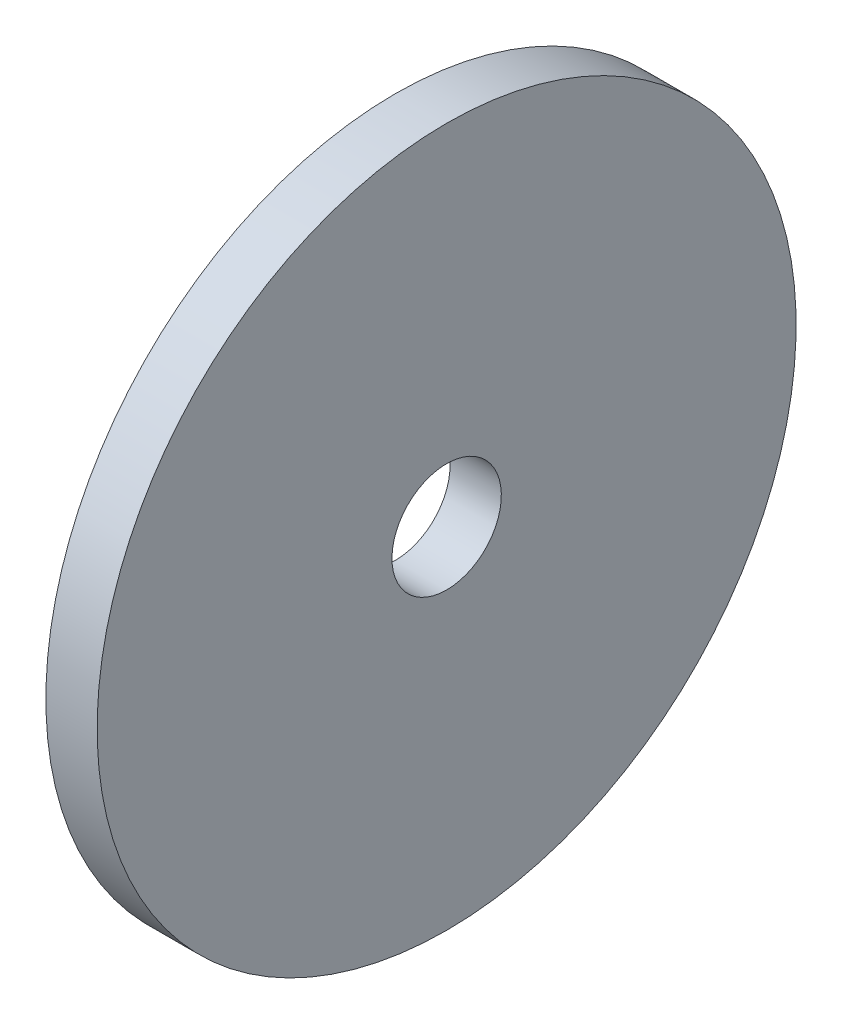
ISO-10303-21;
HEADER;
FILE_DESCRIPTION(('STEP AP214'),'2;1');
FILE_NAME('part.step','',(''),(''),'','','');
FILE_SCHEMA(('AUTOMOTIVE_DESIGN { 1 0 10303 214 1 1 1 1 }'));
ENDSEC;
DATA;
#1=APPLICATION_CONTEXT('core data for automotive mechanical design processes');
#2=APPLICATION_PROTOCOL_DEFINITION('international standard','automotive_design',2000,#1);
#3=PRODUCT_CONTEXT('',#1,'mechanical');
#4=PRODUCT('Part','Part','',(#3));
#5=PRODUCT_RELATED_PRODUCT_CATEGORY('part','',(#4));
#6=PRODUCT_DEFINITION_FORMATION('','',#4);
#7=PRODUCT_DEFINITION_CONTEXT('part definition',#1,'design');
#8=PRODUCT_DEFINITION('design','',#6,#7);
#9=PRODUCT_DEFINITION_SHAPE('','',#8);
#10=(LENGTH_UNIT() NAMED_UNIT(*) SI_UNIT(.MILLI.,.METRE.));
#11=(NAMED_UNIT(*) PLANE_ANGLE_UNIT() SI_UNIT($,.RADIAN.));
#12=(NAMED_UNIT(*) SI_UNIT($,.STERADIAN.) SOLID_ANGLE_UNIT());
#13=UNCERTAINTY_MEASURE_WITH_UNIT(LENGTH_MEASURE(1.E-05),#10,'distance_accuracy_value','');
#14=(GEOMETRIC_REPRESENTATION_CONTEXT(3) GLOBAL_UNCERTAINTY_ASSIGNED_CONTEXT((#13)) GLOBAL_UNIT_ASSIGNED_CONTEXT((#10,
#11,#12)) REPRESENTATION_CONTEXT('',''));
#15=CARTESIAN_POINT('',(0.,0.,0.));
#16=DIRECTION('',(0.,0.,1.));
#17=DIRECTION('',(1.,0.,0.));
#18=AXIS2_PLACEMENT_3D('',#15,#16,#17);
#19=CARTESIAN_POINT('',(-585.,7.7715611723761E-13,0.));
#20=DIRECTION('',(-1.,0.,0.));
#21=DIRECTION('',(0.,-1.,0.));
#22=AXIS2_PLACEMENT_3D('',#19,#20,#21);
#23=CYLINDRICAL_SURFACE('',#22,16.0000000000001);
#24=CARTESIAN_POINT('',(-585.,7.7715611723761E-13,0.));
#25=DIRECTION('',(-1.,0.,0.));
#26=DIRECTION('',(0.,-0.999999999999992,0.));
#27=AXIS2_PLACEMENT_3D('',#24,#25,#26);
#28=CIRCLE('',#27,16.0000000000001);
#29=CARTESIAN_POINT('',(-585.,-15.9999999999992,0.));
#30=VERTEX_POINT('',#29);
#31=EDGE_CURVE('E43',#30,#30,#28,.T.);
#32=ORIENTED_EDGE('',*,*,#31,.T.);
#33=EDGE_LOOP('',(#32));
#34=FACE_BOUND('',#33,.T.);
#35=CARTESIAN_POINT('',(-570.,7.79820652496709E-13,0.));
#36=DIRECTION('',(-1.,0.,0.));
#37=DIRECTION('',(0.,-1.,0.));
#38=AXIS2_PLACEMENT_3D('',#35,#36,#37);
#39=CIRCLE('',#38,16.0000000000001);
#40=CARTESIAN_POINT('',(-570.,-15.9999999999993,0.));
#41=VERTEX_POINT('',#40);
#42=EDGE_CURVE('E49',#41,#41,#39,.T.);
#43=ORIENTED_EDGE('',*,*,#42,.F.);
#44=EDGE_LOOP('',(#43));
#45=FACE_BOUND('',#44,.T.);
#46=ADVANCED_FACE('F35',(#34,#45),#23,.F.);
#47=CARTESIAN_POINT('',(-585.,7.7715611723761E-13,0.));
#48=DIRECTION('',(-1.,0.,0.));
#49=DIRECTION('',(0.,-1.,0.));
#50=AXIS2_PLACEMENT_3D('',#47,#48,#49);
#51=CYLINDRICAL_SURFACE('',#50,102.25);
#52=CARTESIAN_POINT('',(-585.,7.7715611723761E-13,0.));
#53=DIRECTION('',(-1.,0.,0.));
#54=DIRECTION('',(0.,-0.999999999999992,0.));
#55=AXIS2_PLACEMENT_3D('',#52,#53,#54);
#56=CIRCLE('',#55,102.25);
#57=CARTESIAN_POINT('',(-585.,-102.249999999998,0.));
#58=VERTEX_POINT('',#57);
#59=EDGE_CURVE('E10',#58,#58,#56,.T.);
#60=ORIENTED_EDGE('',*,*,#59,.F.);
#61=EDGE_LOOP('',(#60));
#62=FACE_BOUND('',#61,.T.);
#63=CARTESIAN_POINT('',(-570.,7.79820652496709E-13,0.));
#64=DIRECTION('',(-1.,0.,0.));
#65=DIRECTION('',(0.,-1.,0.));
#66=AXIS2_PLACEMENT_3D('',#63,#64,#65);
#67=CIRCLE('',#66,102.25);
#68=CARTESIAN_POINT('',(-570.,-102.249999999999,0.));
#69=VERTEX_POINT('',#68);
#70=EDGE_CURVE('E39',#69,#69,#67,.T.);
#71=ORIENTED_EDGE('',*,*,#70,.T.);
#72=EDGE_LOOP('',(#71));
#73=FACE_BOUND('',#72,.T.);
#74=ADVANCED_FACE('F37',(#62,#73),#51,.T.);
#75=CARTESIAN_POINT('',(-585.,7.7715611723761E-13,0.));
#76=DIRECTION('',(-1.,0.,0.));
#77=DIRECTION('',(0.,-0.999999999999992,0.));
#78=AXIS2_PLACEMENT_3D('',#75,#76,#77);
#79=PLANE('',#78);
#80=ORIENTED_EDGE('',*,*,#31,.F.);
#81=EDGE_LOOP('',(#80));
#82=FACE_BOUND('',#81,.T.);
#83=ORIENTED_EDGE('',*,*,#59,.T.);
#84=EDGE_LOOP('',(#83));
#85=FACE_BOUND('',#84,.T.);
#86=ADVANCED_FACE('F59',(#82,#85),#79,.T.);
#87=CARTESIAN_POINT('',(-570.,7.79820652496709E-13,0.));
#88=DIRECTION('',(-1.,0.,0.));
#89=DIRECTION('',(0.,-0.999999999999992,0.));
#90=AXIS2_PLACEMENT_3D('',#87,#88,#89);
#91=PLANE('',#90);
#92=ORIENTED_EDGE('',*,*,#42,.T.);
#93=EDGE_LOOP('',(#92));
#94=FACE_BOUND('',#93,.T.);
#95=ORIENTED_EDGE('',*,*,#70,.F.);
#96=EDGE_LOOP('',(#95));
#97=FACE_BOUND('',#96,.T.);
#98=ADVANCED_FACE('F57',(#94,#97),#91,.F.);
#99=CLOSED_SHELL('',(#46,#74,#86,#98));
#100=MANIFOLD_SOLID_BREP('B2',#99);
#101=ADVANCED_BREP_SHAPE_REPRESENTATION('',(#18,#100),#14);
#102=SHAPE_DEFINITION_REPRESENTATION(#9,#101);
ENDSEC;
END-ISO-10303-21;
